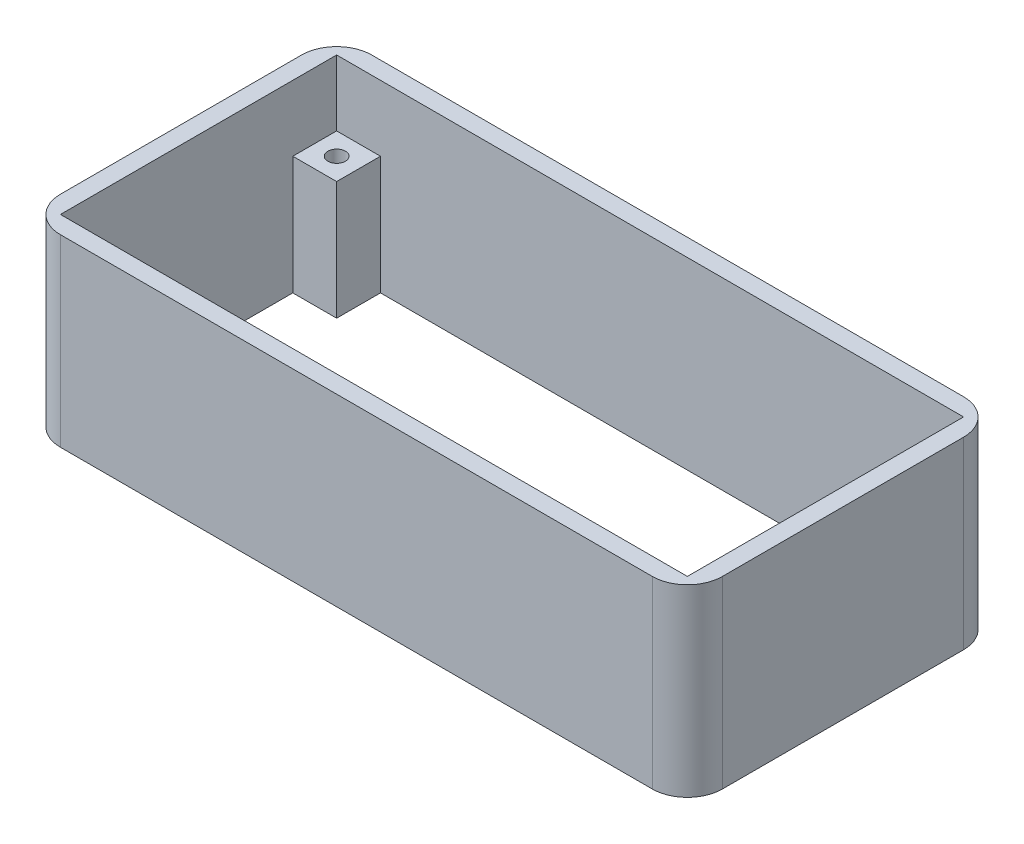
ISO-10303-21;
HEADER;
FILE_DESCRIPTION(('STEP AP214'),'2;1');
FILE_NAME('part.step','',(''),(''),'','','');
FILE_SCHEMA(('AUTOMOTIVE_DESIGN { 1 0 10303 214 1 1 1 1 }'));
ENDSEC;
DATA;
#1=APPLICATION_CONTEXT('core data for automotive mechanical design processes');
#2=APPLICATION_PROTOCOL_DEFINITION('international standard','automotive_design',2000,#1);
#3=PRODUCT_CONTEXT('',#1,'mechanical');
#4=PRODUCT('Part','Part','',(#3));
#5=PRODUCT_RELATED_PRODUCT_CATEGORY('part','',(#4));
#6=PRODUCT_DEFINITION_FORMATION('','',#4);
#7=PRODUCT_DEFINITION_CONTEXT('part definition',#1,'design');
#8=PRODUCT_DEFINITION('design','',#6,#7);
#9=PRODUCT_DEFINITION_SHAPE('','',#8);
#10=(LENGTH_UNIT() NAMED_UNIT(*) SI_UNIT(.MILLI.,.METRE.));
#11=(NAMED_UNIT(*) PLANE_ANGLE_UNIT() SI_UNIT($,.RADIAN.));
#12=(NAMED_UNIT(*) SI_UNIT($,.STERADIAN.) SOLID_ANGLE_UNIT());
#13=UNCERTAINTY_MEASURE_WITH_UNIT(LENGTH_MEASURE(1.E-05),#10,'distance_accuracy_value','');
#14=(GEOMETRIC_REPRESENTATION_CONTEXT(3) GLOBAL_UNCERTAINTY_ASSIGNED_CONTEXT((#13)) GLOBAL_UNIT_ASSIGNED_CONTEXT((#10,
#11,#12)) REPRESENTATION_CONTEXT('',''));
#15=CARTESIAN_POINT('',(0.,0.,0.));
#16=DIRECTION('',(0.,0.,1.));
#17=DIRECTION('',(1.,0.,0.));
#18=AXIS2_PLACEMENT_3D('',#15,#16,#17);
#19=CARTESIAN_POINT('',(0.,42.,-26.4520007733231));
#20=DIRECTION('',(0.,0.,-1.));
#21=DIRECTION('',(-1.,0.,0.));
#22=AXIS2_PLACEMENT_3D('',#19,#20,#21);
#23=PLANE('',#22);
#24=DIRECTION('',(0.,-1.,0.));
#25=VECTOR('',#24,1.);
#26=CARTESIAN_POINT('',(38.2916384268437,27.,-26.4520007733231));
#27=LINE('',#26,#25);
#28=CARTESIAN_POINT('',(38.2916384268437,27.,-26.4520007733231));
#29=VERTEX_POINT('',#28);
#30=CARTESIAN_POINT('',(38.2916384268437,0.,-26.4520007733231));
#31=VERTEX_POINT('',#30);
#32=EDGE_CURVE('E48',#29,#31,#27,.T.);
#33=ORIENTED_EDGE('',*,*,#32,.F.);
#34=DIRECTION('',(1.,0.,0.));
#35=VECTOR('',#34,1.);
#36=CARTESIAN_POINT('',(0.,27.,-26.4520007733231));
#37=LINE('',#36,#35);
#38=CARTESIAN_POINT('',(48.2916384268437,27.,-26.4520007733231));
#39=VERTEX_POINT('',#38);
#40=EDGE_CURVE('E210',#29,#39,#37,.T.);
#41=ORIENTED_EDGE('',*,*,#40,.T.);
#42=DIRECTION('',(0.,-1.,0.));
#43=VECTOR('',#42,1.);
#44=CARTESIAN_POINT('',(48.2916384268437,42.,-26.4520007733231));
#45=LINE('',#44,#43);
#46=CARTESIAN_POINT('',(48.2916384268437,42.,-26.4520007733231));
#47=VERTEX_POINT('',#46);
#48=EDGE_CURVE('E345',#47,#39,#45,.T.);
#49=ORIENTED_EDGE('',*,*,#48,.F.);
#50=DIRECTION('',(1.,0.,0.));
#51=VECTOR('',#50,1.);
#52=CARTESIAN_POINT('',(0.,42.,-26.4520007733231));
#53=LINE('',#52,#51);
#54=CARTESIAN_POINT('',(-94.7083615731563,42.,-26.4520007733231));
#55=VERTEX_POINT('',#54);
#56=EDGE_CURVE('E280',#55,#47,#53,.T.);
#57=ORIENTED_EDGE('',*,*,#56,.F.);
#58=DIRECTION('',(0.,-1.,0.));
#59=VECTOR('',#58,1.);
#60=CARTESIAN_POINT('',(-94.7083615731563,42.,-26.4520007733231));
#61=LINE('',#60,#59);
#62=CARTESIAN_POINT('',(-94.7083615731563,27.,-26.4520007733231));
#63=VERTEX_POINT('',#62);
#64=EDGE_CURVE('E311',#55,#63,#61,.T.);
#65=ORIENTED_EDGE('',*,*,#64,.T.);
#66=DIRECTION('',(1.,0.,0.));
#67=VECTOR('',#66,1.);
#68=CARTESIAN_POINT('',(0.,27.,-26.4520007733231));
#69=LINE('',#68,#67);
#70=CARTESIAN_POINT('',(-84.7083615731563,27.,-26.4520007733231));
#71=VERTEX_POINT('',#70);
#72=EDGE_CURVE('E382',#63,#71,#69,.T.);
#73=ORIENTED_EDGE('',*,*,#72,.T.);
#74=DIRECTION('',(0.,-1.,0.));
#75=VECTOR('',#74,1.);
#76=CARTESIAN_POINT('',(-84.7083615731563,27.,-26.4520007733231));
#77=LINE('',#76,#75);
#78=CARTESIAN_POINT('',(-84.7083615731563,0.,-26.4520007733231));
#79=VERTEX_POINT('',#78);
#80=EDGE_CURVE('E41',#71,#79,#77,.T.);
#81=ORIENTED_EDGE('',*,*,#80,.T.);
#82=DIRECTION('',(1.,0.,0.));
#83=VECTOR('',#82,1.);
#84=CARTESIAN_POINT('',(0.,0.,-26.4520007733231));
#85=LINE('',#84,#83);
#86=EDGE_CURVE('E53',#79,#31,#85,.T.);
#87=ORIENTED_EDGE('',*,*,#86,.T.);
#88=EDGE_LOOP('',(#33,#41,#49,#57,#65,#73,#81,#87));
#89=FACE_BOUND('',#88,.T.);
#90=ADVANCED_FACE('F33',(#89),#23,.F.);
#91=CARTESIAN_POINT('',(48.2916384268437,42.,0.));
#92=DIRECTION('',(1.,0.,0.));
#93=DIRECTION('',(0.,0.,-1.));
#94=AXIS2_PLACEMENT_3D('',#91,#92,#93);
#95=PLANE('',#94);
#96=DIRECTION('',(0.,-1.,0.));
#97=VECTOR('',#96,1.);
#98=CARTESIAN_POINT('',(48.2916384268437,27.,-16.4520007733231));
#99=LINE('',#98,#97);
#100=CARTESIAN_POINT('',(48.2916384268437,27.,-16.4520007733231));
#101=VERTEX_POINT('',#100);
#102=CARTESIAN_POINT('',(48.2916384268437,0.,-16.4520007733231));
#103=VERTEX_POINT('',#102);
#104=EDGE_CURVE('E202',#101,#103,#99,.T.);
#105=ORIENTED_EDGE('',*,*,#104,.T.);
#106=DIRECTION('',(0.,0.,1.));
#107=VECTOR('',#106,1.);
#108=CARTESIAN_POINT('',(48.2916384268437,0.,0.));
#109=LINE('',#108,#107);
#110=CARTESIAN_POINT('',(48.2916384268437,0.,26.5479992266769));
#111=VERTEX_POINT('',#110);
#112=EDGE_CURVE('E313',#103,#111,#109,.T.);
#113=ORIENTED_EDGE('',*,*,#112,.T.);
#114=DIRECTION('',(0.,-1.,0.));
#115=VECTOR('',#114,1.);
#116=CARTESIAN_POINT('',(48.2916384268437,27.,26.5479992266769));
#117=LINE('',#116,#115);
#118=CARTESIAN_POINT('',(48.2916384268437,27.,26.5479992266769));
#119=VERTEX_POINT('',#118);
#120=EDGE_CURVE('E238',#119,#111,#117,.T.);
#121=ORIENTED_EDGE('',*,*,#120,.F.);
#122=DIRECTION('',(0.,0.,1.));
#123=VECTOR('',#122,1.);
#124=CARTESIAN_POINT('',(48.2916384268437,27.,0.));
#125=LINE('',#124,#123);
#126=CARTESIAN_POINT('',(48.2916384268437,27.,36.5479992266769));
#127=VERTEX_POINT('',#126);
#128=EDGE_CURVE('E236',#119,#127,#125,.T.);
#129=ORIENTED_EDGE('',*,*,#128,.T.);
#130=DIRECTION('',(0.,-1.,0.));
#131=VECTOR('',#130,1.);
#132=CARTESIAN_POINT('',(48.2916384268437,42.,36.5479992266769));
#133=LINE('',#132,#131);
#134=CARTESIAN_POINT('',(48.2916384268437,42.,36.5479992266769));
#135=VERTEX_POINT('',#134);
#136=EDGE_CURVE('E368',#135,#127,#133,.T.);
#137=ORIENTED_EDGE('',*,*,#136,.F.);
#138=DIRECTION('',(0.,0.,1.));
#139=VECTOR('',#138,1.);
#140=CARTESIAN_POINT('',(48.2916384268437,42.,0.));
#141=LINE('',#140,#139);
#142=EDGE_CURVE('E283',#47,#135,#141,.T.);
#143=ORIENTED_EDGE('',*,*,#142,.F.);
#144=ORIENTED_EDGE('',*,*,#48,.T.);
#145=DIRECTION('',(0.,0.,1.));
#146=VECTOR('',#145,1.);
#147=CARTESIAN_POINT('',(48.2916384268437,27.,0.));
#148=LINE('',#147,#146);
#149=EDGE_CURVE('E205',#39,#101,#148,.T.);
#150=ORIENTED_EDGE('',*,*,#149,.T.);
#151=EDGE_LOOP('',(#105,#113,#121,#129,#137,#143,#144,#150));
#152=FACE_BOUND('',#151,.T.);
#153=ADVANCED_FACE('F424',(#152),#95,.F.);
#154=CARTESIAN_POINT('',(0.,27.,-16.4520007733231));
#155=DIRECTION('',(0.,0.,-1.));
#156=DIRECTION('',(-1.,0.,0.));
#157=AXIS2_PLACEMENT_3D('',#154,#155,#156);
#158=PLANE('',#157);
#159=DIRECTION('',(1.,0.,0.));
#160=VECTOR('',#159,1.);
#161=CARTESIAN_POINT('',(0.,0.,-16.4520007733231));
#162=LINE('',#161,#160);
#163=CARTESIAN_POINT('',(-94.7083615731563,0.,-16.4520007733231));
#164=VERTEX_POINT('',#163);
#165=CARTESIAN_POINT('',(-84.7083615731563,0.,-16.4520007733231));
#166=VERTEX_POINT('',#165);
#167=EDGE_CURVE('E390',#164,#166,#162,.T.);
#168=ORIENTED_EDGE('',*,*,#167,.T.);
#169=DIRECTION('',(0.,-1.,0.));
#170=VECTOR('',#169,1.);
#171=CARTESIAN_POINT('',(-84.7083615731563,27.,-16.4520007733231));
#172=LINE('',#171,#170);
#173=CARTESIAN_POINT('',(-84.7083615731563,27.,-16.4520007733231));
#174=VERTEX_POINT('',#173);
#175=EDGE_CURVE('E11',#174,#166,#172,.T.);
#176=ORIENTED_EDGE('',*,*,#175,.F.);
#177=DIRECTION('',(1.,0.,0.));
#178=VECTOR('',#177,1.);
#179=CARTESIAN_POINT('',(0.,27.,-16.4520007733231));
#180=LINE('',#179,#178);
#181=CARTESIAN_POINT('',(-94.7083615731563,27.,-16.4520007733231));
#182=VERTEX_POINT('',#181);
#183=EDGE_CURVE('E376',#182,#174,#180,.T.);
#184=ORIENTED_EDGE('',*,*,#183,.F.);
#185=DIRECTION('',(0.,-1.,0.));
#186=VECTOR('',#185,1.);
#187=CARTESIAN_POINT('',(-94.7083615731563,27.,-16.4520007733231));
#188=LINE('',#187,#186);
#189=EDGE_CURVE('E387',#182,#164,#188,.T.);
#190=ORIENTED_EDGE('',*,*,#189,.T.);
#191=EDGE_LOOP('',(#168,#176,#184,#190));
#192=FACE_BOUND('',#191,.T.);
#193=ADVANCED_FACE('F429',(#192),#158,.F.);
#194=CARTESIAN_POINT('',(-84.7083615731563,27.,1.17556466745989E-13));
#195=DIRECTION('',(-1.,0.,0.));
#196=DIRECTION('',(0.,0.,1.));
#197=AXIS2_PLACEMENT_3D('',#194,#195,#196);
#198=PLANE('',#197);
#199=DIRECTION('',(0.,0.,-1.));
#200=VECTOR('',#199,1.);
#201=CARTESIAN_POINT('',(-84.7083615731563,0.,1.17556466745989E-13));
#202=LINE('',#201,#200);
#203=EDGE_CURVE('E377',#166,#79,#202,.T.);
#204=ORIENTED_EDGE('',*,*,#203,.T.);
#205=ORIENTED_EDGE('',*,*,#80,.F.);
#206=DIRECTION('',(0.,0.,-1.));
#207=VECTOR('',#206,1.);
#208=CARTESIAN_POINT('',(-84.7083615731563,27.,1.17556466745989E-13));
#209=LINE('',#208,#207);
#210=EDGE_CURVE('E380',#174,#71,#209,.T.);
#211=ORIENTED_EDGE('',*,*,#210,.F.);
#212=ORIENTED_EDGE('',*,*,#175,.T.);
#213=EDGE_LOOP('',(#204,#205,#211,#212));
#214=FACE_BOUND('',#213,.T.);
#215=ADVANCED_FACE('F441',(#214),#198,.F.);
#216=CARTESIAN_POINT('',(-89.7083615731563,27.,-21.4520007733231));
#217=DIRECTION('',(0.,-1.,0.));
#218=DIRECTION('',(0.,0.,-1.));
#219=AXIS2_PLACEMENT_3D('',#216,#217,#218);
#220=CYLINDRICAL_SURFACE('',#219,2.);
#221=CARTESIAN_POINT('',(-89.7083615731563,27.,-21.4520007733231));
#222=DIRECTION('',(0.,1.,0.));
#223=DIRECTION('',(0.,0.,1.));
#224=AXIS2_PLACEMENT_3D('',#221,#222,#223);
#225=CIRCLE('',#224,2.);
#226=CARTESIAN_POINT('',(-89.7083615731563,27.,-19.4520007733231));
#227=VERTEX_POINT('',#226);
#228=EDGE_CURVE('E373',#227,#227,#225,.T.);
#229=ORIENTED_EDGE('',*,*,#228,.T.);
#230=EDGE_LOOP('',(#229));
#231=FACE_BOUND('',#230,.T.);
#232=CARTESIAN_POINT('',(-89.7083615731563,0.,-21.4520007733231));
#233=DIRECTION('',(0.,1.,0.));
#234=DIRECTION('',(0.,0.,1.));
#235=AXIS2_PLACEMENT_3D('',#232,#233,#234);
#236=CIRCLE('',#235,2.);
#237=CARTESIAN_POINT('',(-89.7083615731563,0.,-19.4520007733231));
#238=VERTEX_POINT('',#237);
#239=EDGE_CURVE('E362',#238,#238,#236,.T.);
#240=ORIENTED_EDGE('',*,*,#239,.F.);
#241=EDGE_LOOP('',(#240));
#242=FACE_BOUND('',#241,.T.);
#243=ADVANCED_FACE('F35',(#231,#242),#220,.F.);
#244=CARTESIAN_POINT('',(0.,27.,0.));
#245=DIRECTION('',(0.,1.,0.));
#246=DIRECTION('',(0.,0.,1.));
#247=AXIS2_PLACEMENT_3D('',#244,#245,#246);
#248=PLANE('',#247);
#249=ORIENTED_EDGE('',*,*,#228,.F.);
#250=EDGE_LOOP('',(#249));
#251=FACE_BOUND('',#250,.T.);
#252=ORIENTED_EDGE('',*,*,#183,.T.);
#253=ORIENTED_EDGE('',*,*,#210,.T.);
#254=ORIENTED_EDGE('',*,*,#72,.F.);
#255=DIRECTION('',(0.,0.,1.));
#256=VECTOR('',#255,1.);
#257=CARTESIAN_POINT('',(-94.7083615731563,27.,0.));
#258=LINE('',#257,#256);
#259=EDGE_CURVE('E385',#63,#182,#258,.T.);
#260=ORIENTED_EDGE('',*,*,#259,.T.);
#261=EDGE_LOOP('',(#252,#253,#254,#260));
#262=FACE_BOUND('',#261,.T.);
#263=ADVANCED_FACE('F434',(#251,#262),#248,.T.);
#264=CARTESIAN_POINT('',(0.,0.,0.));
#265=DIRECTION('',(0.,1.,0.));
#266=DIRECTION('',(0.,0.,1.));
#267=AXIS2_PLACEMENT_3D('',#264,#265,#266);
#268=PLANE('',#267);
#269=ORIENTED_EDGE('',*,*,#86,.F.);
#270=ORIENTED_EDGE('',*,*,#203,.F.);
#271=ORIENTED_EDGE('',*,*,#167,.F.);
#272=DIRECTION('',(0.,0.,1.));
#273=VECTOR('',#272,1.);
#274=CARTESIAN_POINT('',(-94.7083615731563,0.,0.));
#275=LINE('',#274,#273);
#276=CARTESIAN_POINT('',(-94.7083615731563,0.,26.5479992266769));
#277=VERTEX_POINT('',#276);
#278=EDGE_CURVE('E318',#164,#277,#275,.T.);
#279=ORIENTED_EDGE('',*,*,#278,.T.);
#280=DIRECTION('',(1.,0.,0.));
#281=VECTOR('',#280,1.);
#282=CARTESIAN_POINT('',(0.,0.,26.5479992266769));
#283=LINE('',#282,#281);
#284=CARTESIAN_POINT('',(-84.7083615731563,0.,26.5479992266769));
#285=VERTEX_POINT('',#284);
#286=EDGE_CURVE('E256',#277,#285,#283,.T.);
#287=ORIENTED_EDGE('',*,*,#286,.T.);
#288=DIRECTION('',(0.,0.,1.));
#289=VECTOR('',#288,1.);
#290=CARTESIAN_POINT('',(-84.7083615731563,0.,0.));
#291=LINE('',#290,#289);
#292=CARTESIAN_POINT('',(-84.7083615731563,0.,36.5479992266769));
#293=VERTEX_POINT('',#292);
#294=EDGE_CURVE('E269',#285,#293,#291,.T.);
#295=ORIENTED_EDGE('',*,*,#294,.T.);
#296=DIRECTION('',(1.,0.,0.));
#297=VECTOR('',#296,1.);
#298=CARTESIAN_POINT('',(0.,0.,36.5479992266769));
#299=LINE('',#298,#297);
#300=CARTESIAN_POINT('',(38.2916384268437,0.,36.5479992266769));
#301=VERTEX_POINT('',#300);
#302=EDGE_CURVE('E315',#293,#301,#299,.T.);
#303=ORIENTED_EDGE('',*,*,#302,.T.);
#304=DIRECTION('',(0.,0.,-1.));
#305=VECTOR('',#304,1.);
#306=CARTESIAN_POINT('',(38.2916384268437,0.,0.));
#307=LINE('',#306,#305);
#308=CARTESIAN_POINT('',(38.2916384268437,0.,26.5479992266769));
#309=VERTEX_POINT('',#308);
#310=EDGE_CURVE('E229',#301,#309,#307,.T.);
#311=ORIENTED_EDGE('',*,*,#310,.T.);
#312=DIRECTION('',(1.,0.,0.));
#313=VECTOR('',#312,1.);
#314=CARTESIAN_POINT('',(0.,0.,26.5479992266769));
#315=LINE('',#314,#313);
#316=EDGE_CURVE('E220',#309,#111,#315,.T.);
#317=ORIENTED_EDGE('',*,*,#316,.T.);
#318=ORIENTED_EDGE('',*,*,#112,.F.);
#319=DIRECTION('',(1.,0.,0.));
#320=VECTOR('',#319,1.);
#321=CARTESIAN_POINT('',(0.,0.,-16.4520007733231));
#322=LINE('',#321,#320);
#323=CARTESIAN_POINT('',(38.2916384268437,0.,-16.4520007733231));
#324=VERTEX_POINT('',#323);
#325=EDGE_CURVE('E400',#324,#103,#322,.T.);
#326=ORIENTED_EDGE('',*,*,#325,.F.);
#327=DIRECTION('',(0.,0.,1.));
#328=VECTOR('',#327,1.);
#329=CARTESIAN_POINT('',(38.2916384268437,0.,0.));
#330=LINE('',#329,#328);
#331=EDGE_CURVE('E216',#31,#324,#330,.T.);
#332=ORIENTED_EDGE('',*,*,#331,.F.);
#333=EDGE_LOOP('',(#269,#270,#271,#279,#287,#295,#303,#311,#317,#318,#326,#332));
#334=FACE_BOUND('',#333,.T.);
#335=ORIENTED_EDGE('',*,*,#239,.T.);
#336=EDGE_LOOP('',(#335));
#337=FACE_BOUND('',#336,.T.);
#338=DIRECTION('',(0.,0.,1.));
#339=VECTOR('',#338,1.);
#340=CARTESIAN_POINT('',(-98.7083615731563,0.,0.));
#341=LINE('',#340,#339);
#342=CARTESIAN_POINT('',(-98.7083615731563,0.,-22.4520007733231));
#343=VERTEX_POINT('',#342);
#344=CARTESIAN_POINT('',(-98.7083615731563,0.,32.5479992266769));
#345=VERTEX_POINT('',#344);
#346=EDGE_CURVE('E321',#343,#345,#341,.T.);
#347=ORIENTED_EDGE('',*,*,#346,.F.);
#348=CARTESIAN_POINT('',(-90.7083615731563,0.,-22.4520007733231));
#349=DIRECTION('',(0.,1.,0.));
#350=DIRECTION('',(0.,0.,1.));
#351=AXIS2_PLACEMENT_3D('',#348,#349,#350);
#352=CIRCLE('',#351,8.);
#353=CARTESIAN_POINT('',(-90.7083615731563,0.,-30.4520007733231));
#354=VERTEX_POINT('',#353);
#355=EDGE_CURVE('E284',#354,#343,#352,.T.);
#356=ORIENTED_EDGE('',*,*,#355,.F.);
#357=DIRECTION('',(1.,0.,0.));
#358=VECTOR('',#357,1.);
#359=CARTESIAN_POINT('',(0.,0.,-30.4520007733231));
#360=LINE('',#359,#358);
#361=CARTESIAN_POINT('',(44.2916384268437,0.,-30.4520007733231));
#362=VERTEX_POINT('',#361);
#363=EDGE_CURVE('E337',#354,#362,#360,.T.);
#364=ORIENTED_EDGE('',*,*,#363,.T.);
#365=CARTESIAN_POINT('',(44.2916384268437,0.,-22.4520007733231));
#366=DIRECTION('',(0.,1.,0.));
#367=DIRECTION('',(0.,0.,1.));
#368=AXIS2_PLACEMENT_3D('',#365,#366,#367);
#369=CIRCLE('',#368,8.00000000000001);
#370=CARTESIAN_POINT('',(52.2916384268437,0.,-22.4520007733231));
#371=VERTEX_POINT('',#370);
#372=EDGE_CURVE('E334',#371,#362,#369,.T.);
#373=ORIENTED_EDGE('',*,*,#372,.F.);
#374=DIRECTION('',(0.,0.,1.));
#375=VECTOR('',#374,1.);
#376=CARTESIAN_POINT('',(52.2916384268437,0.,0.));
#377=LINE('',#376,#375);
#378=CARTESIAN_POINT('',(52.2916384268437,0.,32.5479992266769));
#379=VERTEX_POINT('',#378);
#380=EDGE_CURVE('E331',#371,#379,#377,.T.);
#381=ORIENTED_EDGE('',*,*,#380,.T.);
#382=CARTESIAN_POINT('',(44.2916384268437,0.,32.5479992266769));
#383=DIRECTION('',(0.,1.,0.));
#384=DIRECTION('',(0.,0.,1.));
#385=AXIS2_PLACEMENT_3D('',#382,#383,#384);
#386=CIRCLE('',#385,8.00000000000001);
#387=CARTESIAN_POINT('',(44.2916384268437,0.,40.5479992266769));
#388=VERTEX_POINT('',#387);
#389=EDGE_CURVE('E328',#388,#379,#386,.T.);
#390=ORIENTED_EDGE('',*,*,#389,.F.);
#391=DIRECTION('',(1.,0.,0.));
#392=VECTOR('',#391,1.);
#393=CARTESIAN_POINT('',(0.,0.,40.5479992266769));
#394=LINE('',#393,#392);
#395=CARTESIAN_POINT('',(-90.7083615731563,0.,40.5479992266769));
#396=VERTEX_POINT('',#395);
#397=EDGE_CURVE('E326',#396,#388,#394,.T.);
#398=ORIENTED_EDGE('',*,*,#397,.F.);
#399=CARTESIAN_POINT('',(-90.7083615731563,0.,32.5479992266769));
#400=DIRECTION('',(0.,1.,0.));
#401=DIRECTION('',(0.,0.,1.));
#402=AXIS2_PLACEMENT_3D('',#399,#400,#401);
#403=CIRCLE('',#402,7.99999999999999);
#404=EDGE_CURVE('E324',#345,#396,#403,.T.);
#405=ORIENTED_EDGE('',*,*,#404,.F.);
#406=EDGE_LOOP('',(#347,#356,#364,#373,#381,#390,#398,#405));
#407=FACE_BOUND('',#406,.T.);
#408=CARTESIAN_POINT('',(-89.7083615731563,0.,31.5479992266769));
#409=DIRECTION('',(0.,1.,0.));
#410=DIRECTION('',(0.,0.,1.));
#411=AXIS2_PLACEMENT_3D('',#408,#409,#410);
#412=CIRCLE('',#411,2.);
#413=CARTESIAN_POINT('',(-89.7083615731563,0.,33.5479992266769));
#414=VERTEX_POINT('',#413);
#415=EDGE_CURVE('E251',#414,#414,#412,.T.);
#416=ORIENTED_EDGE('',*,*,#415,.T.);
#417=EDGE_LOOP('',(#416));
#418=FACE_BOUND('',#417,.T.);
#419=CARTESIAN_POINT('',(43.2916384268437,0.,31.5479992266769));
#420=DIRECTION('',(0.,1.,0.));
#421=DIRECTION('',(0.,0.,1.));
#422=AXIS2_PLACEMENT_3D('',#419,#420,#421);
#423=CIRCLE('',#422,2.);
#424=CARTESIAN_POINT('',(43.2916384268437,0.,33.5479992266769));
#425=VERTEX_POINT('',#424);
#426=EDGE_CURVE('E217',#425,#425,#423,.T.);
#427=ORIENTED_EDGE('',*,*,#426,.T.);
#428=EDGE_LOOP('',(#427));
#429=FACE_BOUND('',#428,.T.);
#430=CARTESIAN_POINT('',(43.2916384268437,0.,-21.4520007733231));
#431=DIRECTION('',(0.,1.,0.));
#432=DIRECTION('',(0.,0.,1.));
#433=AXIS2_PLACEMENT_3D('',#430,#431,#432);
#434=CIRCLE('',#433,2.);
#435=CARTESIAN_POINT('',(43.2916384268437,0.,-19.4520007733231));
#436=VERTEX_POINT('',#435);
#437=EDGE_CURVE('E401',#436,#436,#434,.T.);
#438=ORIENTED_EDGE('',*,*,#437,.T.);
#439=EDGE_LOOP('',(#438));
#440=FACE_BOUND('',#439,.T.);
#441=ADVANCED_FACE('F398',(#334,#337,#407,#418,#429,#440),#268,.F.);
#442=CARTESIAN_POINT('',(-94.7083615731563,42.,0.));
#443=DIRECTION('',(1.,0.,0.));
#444=DIRECTION('',(0.,0.,-1.));
#445=AXIS2_PLACEMENT_3D('',#442,#443,#444);
#446=PLANE('',#445);
#447=DIRECTION('',(0.,-1.,0.));
#448=VECTOR('',#447,1.);
#449=CARTESIAN_POINT('',(-94.7083615731563,27.,26.5479992266769));
#450=LINE('',#449,#448);
#451=CARTESIAN_POINT('',(-94.7083615731563,27.,26.5479992266769));
#452=VERTEX_POINT('',#451);
#453=EDGE_CURVE('E275',#452,#277,#450,.T.);
#454=ORIENTED_EDGE('',*,*,#453,.T.);
#455=ORIENTED_EDGE('',*,*,#278,.F.);
#456=ORIENTED_EDGE('',*,*,#189,.F.);
#457=ORIENTED_EDGE('',*,*,#259,.F.);
#458=ORIENTED_EDGE('',*,*,#64,.F.);
#459=DIRECTION('',(0.,0.,1.));
#460=VECTOR('',#459,1.);
#461=CARTESIAN_POINT('',(-94.7083615731563,42.,0.));
#462=LINE('',#461,#460);
#463=CARTESIAN_POINT('',(-94.7083615731563,42.,36.5479992266769));
#464=VERTEX_POINT('',#463);
#465=EDGE_CURVE('E289',#55,#464,#462,.T.);
#466=ORIENTED_EDGE('',*,*,#465,.T.);
#467=DIRECTION('',(0.,-1.,0.));
#468=VECTOR('',#467,1.);
#469=CARTESIAN_POINT('',(-94.7083615731563,42.,36.5479992266769));
#470=LINE('',#469,#468);
#471=CARTESIAN_POINT('',(-94.7083615731563,27.,36.5479992266769));
#472=VERTEX_POINT('',#471);
#473=EDGE_CURVE('E365',#464,#472,#470,.T.);
#474=ORIENTED_EDGE('',*,*,#473,.T.);
#475=DIRECTION('',(0.,0.,1.));
#476=VECTOR('',#475,1.);
#477=CARTESIAN_POINT('',(-94.7083615731563,27.,0.));
#478=LINE('',#477,#476);
#479=EDGE_CURVE('E262',#452,#472,#478,.T.);
#480=ORIENTED_EDGE('',*,*,#479,.F.);
#481=EDGE_LOOP('',(#454,#455,#456,#457,#458,#466,#474,#480));
#482=FACE_BOUND('',#481,.T.);
#483=ADVANCED_FACE('F440',(#482),#446,.T.);
#484=CARTESIAN_POINT('',(-98.7083615731563,42.,0.));
#485=DIRECTION('',(1.,0.,0.));
#486=DIRECTION('',(0.,0.,-1.));
#487=AXIS2_PLACEMENT_3D('',#484,#485,#486);
#488=PLANE('',#487);
#489=ORIENTED_EDGE('',*,*,#346,.T.);
#490=DIRECTION('',(0.,-1.,0.));
#491=VECTOR('',#490,1.);
#492=CARTESIAN_POINT('',(-98.7083615731563,42.,32.5479992266769));
#493=LINE('',#492,#491);
#494=CARTESIAN_POINT('',(-98.7083615731563,42.,32.5479992266769));
#495=VERTEX_POINT('',#494);
#496=EDGE_CURVE('E359',#495,#345,#493,.T.);
#497=ORIENTED_EDGE('',*,*,#496,.F.);
#498=DIRECTION('',(0.,0.,1.));
#499=VECTOR('',#498,1.);
#500=CARTESIAN_POINT('',(-98.7083615731563,42.,0.));
#501=LINE('',#500,#499);
#502=CARTESIAN_POINT('',(-98.7083615731563,42.,-22.4520007733231));
#503=VERTEX_POINT('',#502);
#504=EDGE_CURVE('E292',#503,#495,#501,.T.);
#505=ORIENTED_EDGE('',*,*,#504,.F.);
#506=DIRECTION('',(0.,-1.,0.));
#507=VECTOR('',#506,1.);
#508=CARTESIAN_POINT('',(-98.7083615731563,42.,-22.4520007733231));
#509=LINE('',#508,#507);
#510=EDGE_CURVE('E341',#503,#343,#509,.T.);
#511=ORIENTED_EDGE('',*,*,#510,.T.);
#512=EDGE_LOOP('',(#489,#497,#505,#511));
#513=FACE_BOUND('',#512,.T.);
#514=ADVANCED_FACE('F545',(#513),#488,.F.);
#515=CARTESIAN_POINT('',(-90.7083615731563,42.,32.5479992266769));
#516=DIRECTION('',(0.,-1.,0.));
#517=DIRECTION('',(0.,0.,-1.));
#518=AXIS2_PLACEMENT_3D('',#515,#516,#517);
#519=CYLINDRICAL_SURFACE('',#518,7.99999999999999);
#520=ORIENTED_EDGE('',*,*,#404,.T.);
#521=DIRECTION('',(0.,-1.,0.));
#522=VECTOR('',#521,1.);
#523=CARTESIAN_POINT('',(-90.7083615731563,42.,40.5479992266769));
#524=LINE('',#523,#522);
#525=CARTESIAN_POINT('',(-90.7083615731563,42.,40.5479992266769));
#526=VERTEX_POINT('',#525);
#527=EDGE_CURVE('E356',#526,#396,#524,.T.);
#528=ORIENTED_EDGE('',*,*,#527,.F.);
#529=CARTESIAN_POINT('',(-90.7083615731563,42.,32.5479992266769));
#530=DIRECTION('',(0.,1.,0.));
#531=DIRECTION('',(0.,0.,1.));
#532=AXIS2_PLACEMENT_3D('',#529,#530,#531);
#533=CIRCLE('',#532,7.99999999999999);
#534=EDGE_CURVE('E295',#495,#526,#533,.T.);
#535=ORIENTED_EDGE('',*,*,#534,.F.);
#536=ORIENTED_EDGE('',*,*,#496,.T.);
#537=EDGE_LOOP('',(#520,#528,#535,#536));
#538=FACE_BOUND('',#537,.T.);
#539=ADVANCED_FACE('F541',(#538),#519,.T.);
#540=CARTESIAN_POINT('',(0.,42.,40.5479992266769));
#541=DIRECTION('',(0.,0.,-1.));
#542=DIRECTION('',(-1.,0.,0.));
#543=AXIS2_PLACEMENT_3D('',#540,#541,#542);
#544=PLANE('',#543);
#545=ORIENTED_EDGE('',*,*,#397,.T.);
#546=DIRECTION('',(0.,-1.,0.));
#547=VECTOR('',#546,1.);
#548=CARTESIAN_POINT('',(44.2916384268437,42.,40.5479992266769));
#549=LINE('',#548,#547);
#550=CARTESIAN_POINT('',(44.2916384268437,42.,40.5479992266769));
#551=VERTEX_POINT('',#550);
#552=EDGE_CURVE('E353',#551,#388,#549,.T.);
#553=ORIENTED_EDGE('',*,*,#552,.F.);
#554=DIRECTION('',(1.,0.,0.));
#555=VECTOR('',#554,1.);
#556=CARTESIAN_POINT('',(0.,42.,40.5479992266769));
#557=LINE('',#556,#555);
#558=EDGE_CURVE('E297',#526,#551,#557,.T.);
#559=ORIENTED_EDGE('',*,*,#558,.F.);
#560=ORIENTED_EDGE('',*,*,#527,.T.);
#561=EDGE_LOOP('',(#545,#553,#559,#560));
#562=FACE_BOUND('',#561,.T.);
#563=ADVANCED_FACE('F537',(#562),#544,.F.);
#564=CARTESIAN_POINT('',(44.2916384268437,42.,32.5479992266769));
#565=DIRECTION('',(0.,-1.,0.));
#566=DIRECTION('',(0.,0.,-1.));
#567=AXIS2_PLACEMENT_3D('',#564,#565,#566);
#568=CYLINDRICAL_SURFACE('',#567,8.00000000000001);
#569=ORIENTED_EDGE('',*,*,#389,.T.);
#570=DIRECTION('',(0.,-1.,0.));
#571=VECTOR('',#570,1.);
#572=CARTESIAN_POINT('',(52.2916384268437,42.,32.5479992266769));
#573=LINE('',#572,#571);
#574=CARTESIAN_POINT('',(52.2916384268437,42.,32.5479992266769));
#575=VERTEX_POINT('',#574);
#576=EDGE_CURVE('E351',#575,#379,#573,.T.);
#577=ORIENTED_EDGE('',*,*,#576,.F.);
#578=CARTESIAN_POINT('',(44.2916384268437,42.,32.5479992266769));
#579=DIRECTION('',(0.,1.,0.));
#580=DIRECTION('',(0.,0.,1.));
#581=AXIS2_PLACEMENT_3D('',#578,#579,#580);
#582=CIRCLE('',#581,8.00000000000001);
#583=EDGE_CURVE('E299',#551,#575,#582,.T.);
#584=ORIENTED_EDGE('',*,*,#583,.F.);
#585=ORIENTED_EDGE('',*,*,#552,.T.);
#586=EDGE_LOOP('',(#569,#577,#584,#585));
#587=FACE_BOUND('',#586,.T.);
#588=ADVANCED_FACE('F533',(#587),#568,.T.);
#589=CARTESIAN_POINT('',(52.2916384268437,42.,0.));
#590=DIRECTION('',(1.,0.,0.));
#591=DIRECTION('',(0.,0.,-1.));
#592=AXIS2_PLACEMENT_3D('',#589,#590,#591);
#593=PLANE('',#592);
#594=ORIENTED_EDGE('',*,*,#380,.F.);
#595=DIRECTION('',(0.,-1.,0.));
#596=VECTOR('',#595,1.);
#597=CARTESIAN_POINT('',(52.2916384268437,42.,-22.4520007733231));
#598=LINE('',#597,#596);
#599=CARTESIAN_POINT('',(52.2916384268437,42.,-22.4520007733231));
#600=VERTEX_POINT('',#599);
#601=EDGE_CURVE('E349',#600,#371,#598,.T.);
#602=ORIENTED_EDGE('',*,*,#601,.F.);
#603=DIRECTION('',(0.,0.,1.));
#604=VECTOR('',#603,1.);
#605=CARTESIAN_POINT('',(52.2916384268437,42.,0.));
#606=LINE('',#605,#604);
#607=EDGE_CURVE('E301',#600,#575,#606,.T.);
#608=ORIENTED_EDGE('',*,*,#607,.T.);
#609=ORIENTED_EDGE('',*,*,#576,.T.);
#610=EDGE_LOOP('',(#594,#602,#608,#609));
#611=FACE_BOUND('',#610,.T.);
#612=ADVANCED_FACE('F529',(#611),#593,.T.);
#613=CARTESIAN_POINT('',(44.2916384268437,42.,-22.4520007733231));
#614=DIRECTION('',(0.,-1.,0.));
#615=DIRECTION('',(0.,0.,-1.));
#616=AXIS2_PLACEMENT_3D('',#613,#614,#615);
#617=CYLINDRICAL_SURFACE('',#616,8.00000000000001);
#618=ORIENTED_EDGE('',*,*,#372,.T.);
#619=DIRECTION('',(0.,-1.,0.));
#620=VECTOR('',#619,1.);
#621=CARTESIAN_POINT('',(44.2916384268437,42.,-30.4520007733231));
#622=LINE('',#621,#620);
#623=CARTESIAN_POINT('',(44.2916384268437,42.,-30.4520007733231));
#624=VERTEX_POINT('',#623);
#625=EDGE_CURVE('E347',#624,#362,#622,.T.);
#626=ORIENTED_EDGE('',*,*,#625,.F.);
#627=CARTESIAN_POINT('',(44.2916384268437,42.,-22.4520007733231));
#628=DIRECTION('',(0.,1.,0.));
#629=DIRECTION('',(0.,0.,1.));
#630=AXIS2_PLACEMENT_3D('',#627,#628,#629);
#631=CIRCLE('',#630,8.00000000000001);
#632=EDGE_CURVE('E304',#600,#624,#631,.T.);
#633=ORIENTED_EDGE('',*,*,#632,.F.);
#634=ORIENTED_EDGE('',*,*,#601,.T.);
#635=EDGE_LOOP('',(#618,#626,#633,#634));
#636=FACE_BOUND('',#635,.T.);
#637=ADVANCED_FACE('F525',(#636),#617,.T.);
#638=CARTESIAN_POINT('',(0.,42.,-30.4520007733231));
#639=DIRECTION('',(0.,0.,-1.));
#640=DIRECTION('',(-1.,0.,0.));
#641=AXIS2_PLACEMENT_3D('',#638,#639,#640);
#642=PLANE('',#641);
#643=ORIENTED_EDGE('',*,*,#363,.F.);
#644=DIRECTION('',(0.,-1.,0.));
#645=VECTOR('',#644,1.);
#646=CARTESIAN_POINT('',(-90.7083615731563,42.,-30.4520007733231));
#647=LINE('',#646,#645);
#648=CARTESIAN_POINT('',(-90.7083615731563,42.,-30.4520007733231));
#649=VERTEX_POINT('',#648);
#650=EDGE_CURVE('E344',#649,#354,#647,.T.);
#651=ORIENTED_EDGE('',*,*,#650,.F.);
#652=DIRECTION('',(1.,0.,0.));
#653=VECTOR('',#652,1.);
#654=CARTESIAN_POINT('',(0.,42.,-30.4520007733231));
#655=LINE('',#654,#653);
#656=EDGE_CURVE('E306',#649,#624,#655,.T.);
#657=ORIENTED_EDGE('',*,*,#656,.T.);
#658=ORIENTED_EDGE('',*,*,#625,.T.);
#659=EDGE_LOOP('',(#643,#651,#657,#658));
#660=FACE_BOUND('',#659,.T.);
#661=ADVANCED_FACE('F522',(#660),#642,.T.);
#662=CARTESIAN_POINT('',(0.,42.,36.5479992266769));
#663=DIRECTION('',(0.,0.,-1.));
#664=DIRECTION('',(-1.,0.,0.));
#665=AXIS2_PLACEMENT_3D('',#662,#663,#664);
#666=PLANE('',#665);
#667=DIRECTION('',(0.,-1.,0.));
#668=VECTOR('',#667,1.);
#669=CARTESIAN_POINT('',(38.2916384268437,27.,36.5479992266769));
#670=LINE('',#669,#668);
#671=CARTESIAN_POINT('',(38.2916384268437,27.,36.5479992266769));
#672=VERTEX_POINT('',#671);
#673=EDGE_CURVE('E246',#672,#301,#670,.T.);
#674=ORIENTED_EDGE('',*,*,#673,.T.);
#675=ORIENTED_EDGE('',*,*,#302,.F.);
#676=DIRECTION('',(0.,-1.,0.));
#677=VECTOR('',#676,1.);
#678=CARTESIAN_POINT('',(-84.7083615731563,27.,36.5479992266769));
#679=LINE('',#678,#677);
#680=CARTESIAN_POINT('',(-84.7083615731563,27.,36.5479992266769));
#681=VERTEX_POINT('',#680);
#682=EDGE_CURVE('E266',#681,#293,#679,.T.);
#683=ORIENTED_EDGE('',*,*,#682,.F.);
#684=DIRECTION('',(1.,0.,0.));
#685=VECTOR('',#684,1.);
#686=CARTESIAN_POINT('',(0.,27.,36.5479992266769));
#687=LINE('',#686,#685);
#688=EDGE_CURVE('E264',#472,#681,#687,.T.);
#689=ORIENTED_EDGE('',*,*,#688,.F.);
#690=ORIENTED_EDGE('',*,*,#473,.F.);
#691=DIRECTION('',(1.,0.,0.));
#692=VECTOR('',#691,1.);
#693=CARTESIAN_POINT('',(0.,42.,36.5479992266769));
#694=LINE('',#693,#692);
#695=EDGE_CURVE('E286',#464,#135,#694,.T.);
#696=ORIENTED_EDGE('',*,*,#695,.T.);
#697=ORIENTED_EDGE('',*,*,#136,.T.);
#698=DIRECTION('',(1.,0.,0.));
#699=VECTOR('',#698,1.);
#700=CARTESIAN_POINT('',(0.,27.,36.5479992266769));
#701=LINE('',#700,#699);
#702=EDGE_CURVE('E234',#672,#127,#701,.T.);
#703=ORIENTED_EDGE('',*,*,#702,.F.);
#704=EDGE_LOOP('',(#674,#675,#683,#689,#690,#696,#697,#703));
#705=FACE_BOUND('',#704,.T.);
#706=ADVANCED_FACE('F467',(#705),#666,.T.);
#707=CARTESIAN_POINT('',(-90.7083615731563,42.,-22.4520007733231));
#708=DIRECTION('',(0.,-1.,0.));
#709=DIRECTION('',(0.,0.,-1.));
#710=AXIS2_PLACEMENT_3D('',#707,#708,#709);
#711=CYLINDRICAL_SURFACE('',#710,8.);
#712=ORIENTED_EDGE('',*,*,#355,.T.);
#713=ORIENTED_EDGE('',*,*,#510,.F.);
#714=CARTESIAN_POINT('',(-90.7083615731563,42.,-22.4520007733231));
#715=DIRECTION('',(0.,1.,0.));
#716=DIRECTION('',(0.,0.,1.));
#717=AXIS2_PLACEMENT_3D('',#714,#715,#716);
#718=CIRCLE('',#717,8.);
#719=EDGE_CURVE('E309',#649,#503,#718,.T.);
#720=ORIENTED_EDGE('',*,*,#719,.F.);
#721=ORIENTED_EDGE('',*,*,#650,.T.);
#722=EDGE_LOOP('',(#712,#713,#720,#721));
#723=FACE_BOUND('',#722,.T.);
#724=ADVANCED_FACE('F518',(#723),#711,.T.);
#725=CARTESIAN_POINT('',(0.,42.,0.));
#726=DIRECTION('',(0.,1.,0.));
#727=DIRECTION('',(0.,0.,1.));
#728=AXIS2_PLACEMENT_3D('',#725,#726,#727);
#729=PLANE('',#728);
#730=ORIENTED_EDGE('',*,*,#56,.T.);
#731=ORIENTED_EDGE('',*,*,#142,.T.);
#732=ORIENTED_EDGE('',*,*,#695,.F.);
#733=ORIENTED_EDGE('',*,*,#465,.F.);
#734=EDGE_LOOP('',(#730,#731,#732,#733));
#735=FACE_BOUND('',#734,.T.);
#736=ORIENTED_EDGE('',*,*,#504,.T.);
#737=ORIENTED_EDGE('',*,*,#534,.T.);
#738=ORIENTED_EDGE('',*,*,#558,.T.);
#739=ORIENTED_EDGE('',*,*,#583,.T.);
#740=ORIENTED_EDGE('',*,*,#607,.F.);
#741=ORIENTED_EDGE('',*,*,#632,.T.);
#742=ORIENTED_EDGE('',*,*,#656,.F.);
#743=ORIENTED_EDGE('',*,*,#719,.T.);
#744=EDGE_LOOP('',(#736,#737,#738,#739,#740,#741,#742,#743));
#745=FACE_BOUND('',#744,.T.);
#746=ADVANCED_FACE('F483',(#735,#745),#729,.T.);
#747=CARTESIAN_POINT('',(-84.7083615731563,27.,0.));
#748=DIRECTION('',(1.,0.,0.));
#749=DIRECTION('',(0.,0.,-1.));
#750=AXIS2_PLACEMENT_3D('',#747,#748,#749);
#751=PLANE('',#750);
#752=ORIENTED_EDGE('',*,*,#294,.F.);
#753=DIRECTION('',(0.,-1.,0.));
#754=VECTOR('',#753,1.);
#755=CARTESIAN_POINT('',(-84.7083615731563,27.,26.5479992266769));
#756=LINE('',#755,#754);
#757=CARTESIAN_POINT('',(-84.7083615731563,27.,26.5479992266769));
#758=VERTEX_POINT('',#757);
#759=EDGE_CURVE('E278',#758,#285,#756,.T.);
#760=ORIENTED_EDGE('',*,*,#759,.F.);
#761=DIRECTION('',(0.,0.,1.));
#762=VECTOR('',#761,1.);
#763=CARTESIAN_POINT('',(-84.7083615731563,27.,0.));
#764=LINE('',#763,#762);
#765=EDGE_CURVE('E255',#758,#681,#764,.T.);
#766=ORIENTED_EDGE('',*,*,#765,.T.);
#767=ORIENTED_EDGE('',*,*,#682,.T.);
#768=EDGE_LOOP('',(#752,#760,#766,#767));
#769=FACE_BOUND('',#768,.T.);
#770=ADVANCED_FACE('F464',(#769),#751,.T.);
#771=CARTESIAN_POINT('',(0.,27.,26.5479992266769));
#772=DIRECTION('',(0.,0.,-1.));
#773=DIRECTION('',(-1.,0.,0.));
#774=AXIS2_PLACEMENT_3D('',#771,#772,#773);
#775=PLANE('',#774);
#776=ORIENTED_EDGE('',*,*,#286,.F.);
#777=ORIENTED_EDGE('',*,*,#453,.F.);
#778=DIRECTION('',(1.,0.,0.));
#779=VECTOR('',#778,1.);
#780=CARTESIAN_POINT('',(0.,27.,26.5479992266769));
#781=LINE('',#780,#779);
#782=EDGE_CURVE('E259',#452,#758,#781,.T.);
#783=ORIENTED_EDGE('',*,*,#782,.T.);
#784=ORIENTED_EDGE('',*,*,#759,.T.);
#785=EDGE_LOOP('',(#776,#777,#783,#784));
#786=FACE_BOUND('',#785,.T.);
#787=ADVANCED_FACE('F456',(#786),#775,.T.);
#788=CARTESIAN_POINT('',(-89.7083615731563,27.,31.5479992266769));
#789=DIRECTION('',(0.,-1.,0.));
#790=DIRECTION('',(0.,0.,-1.));
#791=AXIS2_PLACEMENT_3D('',#788,#789,#790);
#792=CYLINDRICAL_SURFACE('',#791,2.);
#793=CARTESIAN_POINT('',(-89.7083615731563,27.,31.5479992266769));
#794=DIRECTION('',(0.,1.,0.));
#795=DIRECTION('',(0.,0.,1.));
#796=AXIS2_PLACEMENT_3D('',#793,#794,#795);
#797=CIRCLE('',#796,2.);
#798=CARTESIAN_POINT('',(-89.7083615731563,27.,33.5479992266769));
#799=VERTEX_POINT('',#798);
#800=EDGE_CURVE('E252',#799,#799,#797,.T.);
#801=ORIENTED_EDGE('',*,*,#800,.T.);
#802=EDGE_LOOP('',(#801));
#803=FACE_BOUND('',#802,.T.);
#804=ORIENTED_EDGE('',*,*,#415,.F.);
#805=EDGE_LOOP('',(#804));
#806=FACE_BOUND('',#805,.T.);
#807=ADVANCED_FACE('F507',(#803,#806),#792,.F.);
#808=CARTESIAN_POINT('',(0.,27.,0.));
#809=DIRECTION('',(0.,1.,0.));
#810=DIRECTION('',(0.,0.,1.));
#811=AXIS2_PLACEMENT_3D('',#808,#809,#810);
#812=PLANE('',#811);
#813=ORIENTED_EDGE('',*,*,#800,.F.);
#814=EDGE_LOOP('',(#813));
#815=FACE_BOUND('',#814,.T.);
#816=ORIENTED_EDGE('',*,*,#765,.F.);
#817=ORIENTED_EDGE('',*,*,#782,.F.);
#818=ORIENTED_EDGE('',*,*,#479,.T.);
#819=ORIENTED_EDGE('',*,*,#688,.T.);
#820=EDGE_LOOP('',(#816,#817,#818,#819));
#821=FACE_BOUND('',#820,.T.);
#822=ADVANCED_FACE('F459',(#815,#821),#812,.T.);
#823=CARTESIAN_POINT('',(0.,27.,26.5479992266769));
#824=DIRECTION('',(0.,0.,-1.));
#825=DIRECTION('',(-1.,0.,0.));
#826=AXIS2_PLACEMENT_3D('',#823,#824,#825);
#827=PLANE('',#826);
#828=ORIENTED_EDGE('',*,*,#316,.F.);
#829=DIRECTION('',(0.,-1.,0.));
#830=VECTOR('',#829,1.);
#831=CARTESIAN_POINT('',(38.2916384268437,27.,26.5479992266769));
#832=LINE('',#831,#830);
#833=CARTESIAN_POINT('',(38.2916384268437,27.,26.5479992266769));
#834=VERTEX_POINT('',#833);
#835=EDGE_CURVE('E249',#834,#309,#832,.T.);
#836=ORIENTED_EDGE('',*,*,#835,.F.);
#837=DIRECTION('',(1.,0.,0.));
#838=VECTOR('',#837,1.);
#839=CARTESIAN_POINT('',(0.,27.,26.5479992266769));
#840=LINE('',#839,#838);
#841=EDGE_CURVE('E228',#834,#119,#840,.T.);
#842=ORIENTED_EDGE('',*,*,#841,.T.);
#843=ORIENTED_EDGE('',*,*,#120,.T.);
#844=EDGE_LOOP('',(#828,#836,#842,#843));
#845=FACE_BOUND('',#844,.T.);
#846=ADVANCED_FACE('F475',(#845),#827,.T.);
#847=CARTESIAN_POINT('',(38.2916384268437,27.,0.));
#848=DIRECTION('',(-1.,0.,0.));
#849=DIRECTION('',(0.,0.,1.));
#850=AXIS2_PLACEMENT_3D('',#847,#848,#849);
#851=PLANE('',#850);
#852=ORIENTED_EDGE('',*,*,#310,.F.);
#853=ORIENTED_EDGE('',*,*,#673,.F.);
#854=DIRECTION('',(0.,0.,-1.));
#855=VECTOR('',#854,1.);
#856=CARTESIAN_POINT('',(38.2916384268437,27.,0.));
#857=LINE('',#856,#855);
#858=EDGE_CURVE('E231',#672,#834,#857,.T.);
#859=ORIENTED_EDGE('',*,*,#858,.T.);
#860=ORIENTED_EDGE('',*,*,#835,.T.);
#861=EDGE_LOOP('',(#852,#853,#859,#860));
#862=FACE_BOUND('',#861,.T.);
#863=ADVANCED_FACE('F471',(#862),#851,.T.);
#864=CARTESIAN_POINT('',(43.2916384268437,27.,31.5479992266769));
#865=DIRECTION('',(0.,-1.,0.));
#866=DIRECTION('',(0.,0.,-1.));
#867=AXIS2_PLACEMENT_3D('',#864,#865,#866);
#868=CYLINDRICAL_SURFACE('',#867,2.);
#869=CARTESIAN_POINT('',(43.2916384268437,27.,31.5479992266769));
#870=DIRECTION('',(0.,1.,0.));
#871=DIRECTION('',(0.,0.,1.));
#872=AXIS2_PLACEMENT_3D('',#869,#870,#871);
#873=CIRCLE('',#872,2.);
#874=CARTESIAN_POINT('',(43.2916384268437,27.,33.5479992266769));
#875=VERTEX_POINT('',#874);
#876=EDGE_CURVE('E225',#875,#875,#873,.T.);
#877=ORIENTED_EDGE('',*,*,#876,.T.);
#878=EDGE_LOOP('',(#877));
#879=FACE_BOUND('',#878,.T.);
#880=ORIENTED_EDGE('',*,*,#426,.F.);
#881=EDGE_LOOP('',(#880));
#882=FACE_BOUND('',#881,.T.);
#883=ADVANCED_FACE('F489',(#879,#882),#868,.F.);
#884=CARTESIAN_POINT('',(0.,27.,0.));
#885=DIRECTION('',(0.,1.,0.));
#886=DIRECTION('',(0.,0.,1.));
#887=AXIS2_PLACEMENT_3D('',#884,#885,#886);
#888=PLANE('',#887);
#889=ORIENTED_EDGE('',*,*,#876,.F.);
#890=EDGE_LOOP('',(#889));
#891=FACE_BOUND('',#890,.T.);
#892=ORIENTED_EDGE('',*,*,#841,.F.);
#893=ORIENTED_EDGE('',*,*,#858,.F.);
#894=ORIENTED_EDGE('',*,*,#702,.T.);
#895=ORIENTED_EDGE('',*,*,#128,.F.);
#896=EDGE_LOOP('',(#892,#893,#894,#895));
#897=FACE_BOUND('',#896,.T.);
#898=ADVANCED_FACE('F487',(#891,#897),#888,.T.);
#899=CARTESIAN_POINT('',(38.2916384268437,27.,0.));
#900=DIRECTION('',(1.,0.,0.));
#901=DIRECTION('',(0.,0.,-1.));
#902=AXIS2_PLACEMENT_3D('',#899,#900,#901);
#903=PLANE('',#902);
#904=ORIENTED_EDGE('',*,*,#331,.T.);
#905=DIRECTION('',(0.,-1.,0.));
#906=VECTOR('',#905,1.);
#907=CARTESIAN_POINT('',(38.2916384268437,27.,-16.4520007733231));
#908=LINE('',#907,#906);
#909=CARTESIAN_POINT('',(38.2916384268437,27.,-16.4520007733231));
#910=VERTEX_POINT('',#909);
#911=EDGE_CURVE('E199',#910,#324,#908,.T.);
#912=ORIENTED_EDGE('',*,*,#911,.F.);
#913=DIRECTION('',(0.,0.,1.));
#914=VECTOR('',#913,1.);
#915=CARTESIAN_POINT('',(38.2916384268437,27.,0.));
#916=LINE('',#915,#914);
#917=EDGE_CURVE('E206',#29,#910,#916,.T.);
#918=ORIENTED_EDGE('',*,*,#917,.F.);
#919=ORIENTED_EDGE('',*,*,#32,.T.);
#920=EDGE_LOOP('',(#904,#912,#918,#919));
#921=FACE_BOUND('',#920,.T.);
#922=ADVANCED_FACE('F214',(#921),#903,.F.);
#923=CARTESIAN_POINT('',(0.,27.,-16.4520007733231));
#924=DIRECTION('',(0.,0.,-1.));
#925=DIRECTION('',(-1.,0.,0.));
#926=AXIS2_PLACEMENT_3D('',#923,#924,#925);
#927=PLANE('',#926);
#928=ORIENTED_EDGE('',*,*,#325,.T.);
#929=ORIENTED_EDGE('',*,*,#104,.F.);
#930=DIRECTION('',(1.,0.,0.));
#931=VECTOR('',#930,1.);
#932=CARTESIAN_POINT('',(0.,27.,-16.4520007733231));
#933=LINE('',#932,#931);
#934=EDGE_CURVE('E194',#910,#101,#933,.T.);
#935=ORIENTED_EDGE('',*,*,#934,.F.);
#936=ORIENTED_EDGE('',*,*,#911,.T.);
#937=EDGE_LOOP('',(#928,#929,#935,#936));
#938=FACE_BOUND('',#937,.T.);
#939=ADVANCED_FACE('F197',(#938),#927,.F.);
#940=CARTESIAN_POINT('',(43.2916384268437,27.,-21.4520007733231));
#941=DIRECTION('',(0.,-1.,0.));
#942=DIRECTION('',(0.,0.,-1.));
#943=AXIS2_PLACEMENT_3D('',#940,#941,#942);
#944=CYLINDRICAL_SURFACE('',#943,2.);
#945=CARTESIAN_POINT('',(43.2916384268437,27.,-21.4520007733231));
#946=DIRECTION('',(0.,1.,0.));
#947=DIRECTION('',(0.,0.,1.));
#948=AXIS2_PLACEMENT_3D('',#945,#946,#947);
#949=CIRCLE('',#948,2.);
#950=CARTESIAN_POINT('',(43.2916384268437,27.,-19.4520007733231));
#951=VERTEX_POINT('',#950);
#952=EDGE_CURVE('E212',#951,#951,#949,.T.);
#953=ORIENTED_EDGE('',*,*,#952,.T.);
#954=EDGE_LOOP('',(#953));
#955=FACE_BOUND('',#954,.T.);
#956=ORIENTED_EDGE('',*,*,#437,.F.);
#957=EDGE_LOOP('',(#956));
#958=FACE_BOUND('',#957,.T.);
#959=ADVANCED_FACE('F413',(#955,#958),#944,.F.);
#960=CARTESIAN_POINT('',(0.,27.,0.));
#961=DIRECTION('',(0.,1.,0.));
#962=DIRECTION('',(0.,0.,1.));
#963=AXIS2_PLACEMENT_3D('',#960,#961,#962);
#964=PLANE('',#963);
#965=ORIENTED_EDGE('',*,*,#952,.F.);
#966=EDGE_LOOP('',(#965));
#967=FACE_BOUND('',#966,.T.);
#968=ORIENTED_EDGE('',*,*,#917,.T.);
#969=ORIENTED_EDGE('',*,*,#934,.T.);
#970=ORIENTED_EDGE('',*,*,#149,.F.);
#971=ORIENTED_EDGE('',*,*,#40,.F.);
#972=EDGE_LOOP('',(#968,#969,#970,#971));
#973=FACE_BOUND('',#972,.T.);
#974=ADVANCED_FACE('F209',(#967,#973),#964,.T.);
#975=CLOSED_SHELL('',(#90,#153,#193,#215,#243,#263,#441,#483,#514,#539,#563,#588,#612,#637,#661,
#706,#724,#746,#770,#787,#807,#822,#846,#863,#883,#898,#922,#939,#959,#974));
#976=MANIFOLD_SOLID_BREP('B2',#975);
#977=ADVANCED_BREP_SHAPE_REPRESENTATION('',(#18,#976),#14);
#978=SHAPE_DEFINITION_REPRESENTATION(#9,#977);
ENDSEC;
END-ISO-10303-21;
